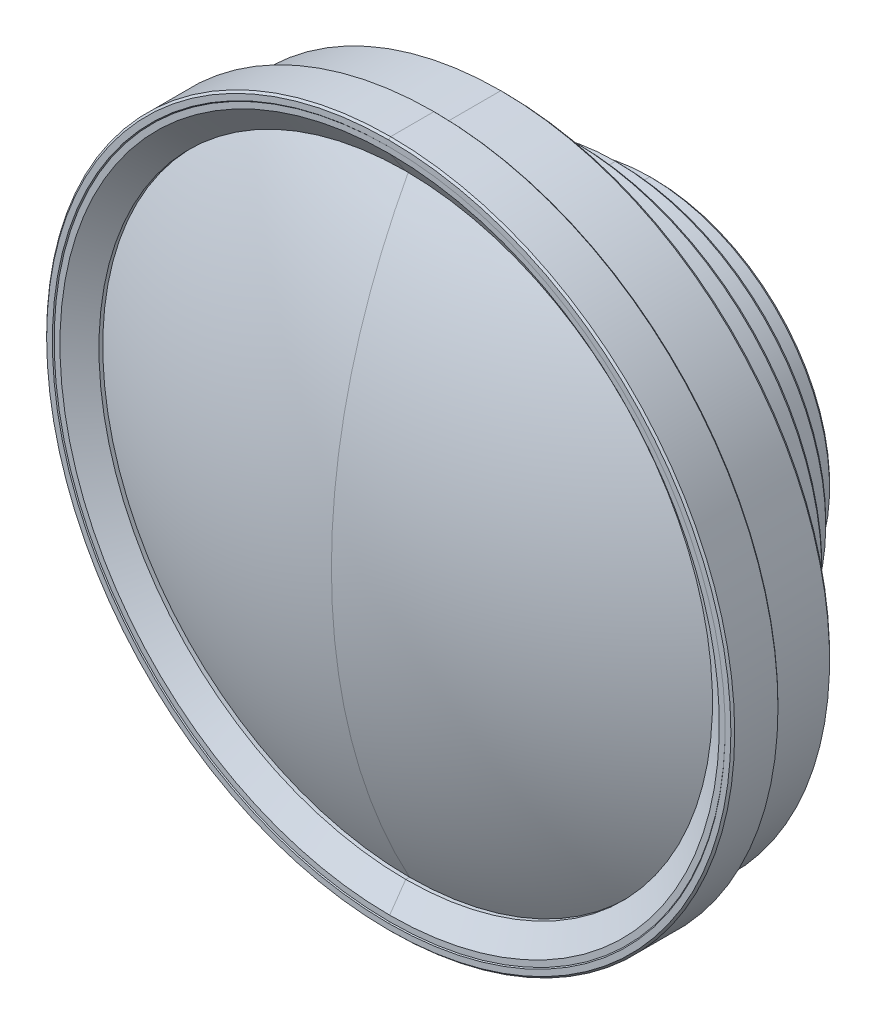
ISO-10303-21;
HEADER;
FILE_DESCRIPTION(('STEP AP214'),'2;1');
FILE_NAME('part.step','',(''),(''),'','','');
FILE_SCHEMA(('AUTOMOTIVE_DESIGN { 1 0 10303 214 1 1 1 1 }'));
ENDSEC;
DATA;
#1=APPLICATION_CONTEXT('core data for automotive mechanical design processes');
#2=APPLICATION_PROTOCOL_DEFINITION('international standard','automotive_design',2000,#1);
#3=PRODUCT_CONTEXT('',#1,'mechanical');
#4=PRODUCT('Part','Part','',(#3));
#5=PRODUCT_RELATED_PRODUCT_CATEGORY('part','',(#4));
#6=PRODUCT_DEFINITION_FORMATION('','',#4);
#7=PRODUCT_DEFINITION_CONTEXT('part definition',#1,'design');
#8=PRODUCT_DEFINITION('design','',#6,#7);
#9=PRODUCT_DEFINITION_SHAPE('','',#8);
#10=(LENGTH_UNIT() NAMED_UNIT(*) SI_UNIT(.MILLI.,.METRE.));
#11=(NAMED_UNIT(*) PLANE_ANGLE_UNIT() SI_UNIT($,.RADIAN.));
#12=(NAMED_UNIT(*) SI_UNIT($,.STERADIAN.) SOLID_ANGLE_UNIT());
#13=UNCERTAINTY_MEASURE_WITH_UNIT(LENGTH_MEASURE(1.E-05),#10,'distance_accuracy_value','');
#14=(GEOMETRIC_REPRESENTATION_CONTEXT(3) GLOBAL_UNCERTAINTY_ASSIGNED_CONTEXT((#13)) GLOBAL_UNIT_ASSIGNED_CONTEXT((#10,
#11,#12)) REPRESENTATION_CONTEXT('',''));
#15=CARTESIAN_POINT('',(0.,0.,0.));
#16=DIRECTION('',(0.,0.,1.));
#17=DIRECTION('',(1.,0.,0.));
#18=AXIS2_PLACEMENT_3D('',#15,#16,#17);
#19=CARTESIAN_POINT('',(0.,0.,-764.4195681488));
#20=DIRECTION('',(0.,0.,-1.));
#21=DIRECTION('',(0.,-1.,0.));
#22=AXIS2_PLACEMENT_3D('',#19,#20,#21);
#23=SPHERICAL_SURFACE('',#22,771.9320364239);
#24=CARTESIAN_POINT('',(0.,0.,6.994453782715));
#25=DIRECTION('',(0.,0.,-1.));
#26=DIRECTION('',(0.,1.,0.));
#27=AXIS2_PLACEMENT_3D('',#24,#25,#26);
#28=CIRCLE('',#27,28.275);
#29=CARTESIAN_POINT('',(0.,28.275,6.994453782715));
#30=VERTEX_POINT('',#29);
#31=CARTESIAN_POINT('',(0.,-28.275,6.994453782715));
#32=VERTEX_POINT('',#31);
#33=EDGE_CURVE('E422',#30,#32,#28,.T.);
#34=ORIENTED_EDGE('',*,*,#33,.T.);
#35=CARTESIAN_POINT('',(0.,0.,-764.4195681488));
#36=DIRECTION('',(1.,0.,0.));
#37=DIRECTION('',(0.,0.,1.));
#38=AXIS2_PLACEMENT_3D('',#35,#36,#37);
#39=CIRCLE('',#38,771.9320364239);
#40=CARTESIAN_POINT('',(0.,0.,7.512468275104));
#41=VERTEX_POINT('',#40);
#42=EDGE_CURVE('E25',#41,#32,#39,.T.);
#43=ORIENTED_EDGE('',*,*,#42,.F.);
#44=CARTESIAN_POINT('',(0.,0.,-764.4195681488));
#45=DIRECTION('',(-1.,0.,0.));
#46=DIRECTION('',(0.,0.,1.));
#47=AXIS2_PLACEMENT_3D('',#44,#45,#46);
#48=CIRCLE('',#47,771.9320364239);
#49=EDGE_CURVE('E9',#41,#30,#48,.T.);
#50=ORIENTED_EDGE('',*,*,#49,.T.);
#51=EDGE_LOOP('',(#34,#43,#50));
#52=FACE_BOUND('',#51,.T.);
#53=ADVANCED_FACE('F14',(#52),#23,.F.);
#54=CARTESIAN_POINT('',(0.,0.,-764.4195681488));
#55=DIRECTION('',(0.,0.,-1.));
#56=DIRECTION('',(0.,-1.,0.));
#57=AXIS2_PLACEMENT_3D('',#54,#55,#56);
#58=SPHERICAL_SURFACE('',#57,771.9320364239);
#59=ORIENTED_EDGE('',*,*,#42,.T.);
#60=CARTESIAN_POINT('',(0.,0.,6.994453782715));
#61=DIRECTION('',(0.,0.,1.));
#62=DIRECTION('',(0.,1.,0.));
#63=AXIS2_PLACEMENT_3D('',#60,#61,#62);
#64=CIRCLE('',#63,28.275);
#65=EDGE_CURVE('E336',#30,#32,#64,.T.);
#66=ORIENTED_EDGE('',*,*,#65,.F.);
#67=ORIENTED_EDGE('',*,*,#49,.F.);
#68=EDGE_LOOP('',(#59,#66,#67));
#69=FACE_BOUND('',#68,.T.);
#70=ADVANCED_FACE('F568',(#69),#58,.F.);
#71=CARTESIAN_POINT('',(0.,0.,-77.28019420175));
#72=DIRECTION('',(0.,0.,-1.));
#73=DIRECTION('',(0.,-1.,0.));
#74=AXIS2_PLACEMENT_3D('',#71,#72,#73);
#75=SPHERICAL_SURFACE('',#74,167.7801892671);
#76=CARTESIAN_POINT('',(0.,0.,70.06338187298));
#77=DIRECTION('',(0.,0.,1.));
#78=DIRECTION('',(0.,1.,0.));
#79=AXIS2_PLACEMENT_3D('',#76,#77,#78);
#80=CIRCLE('',#79,80.25);
#81=CARTESIAN_POINT('',(0.,80.25,70.06338187298));
#82=VERTEX_POINT('',#81);
#83=CARTESIAN_POINT('',(0.,-80.25,70.06338187298));
#84=VERTEX_POINT('',#83);
#85=EDGE_CURVE('E375',#82,#84,#80,.T.);
#86=ORIENTED_EDGE('',*,*,#85,.T.);
#87=CARTESIAN_POINT('',(0.,0.,-77.28019420175));
#88=DIRECTION('',(-1.,0.,0.));
#89=DIRECTION('',(0.,-0.478304383554308,0.878194122431216));
#90=AXIS2_PLACEMENT_3D('',#87,#88,#89);
#91=CIRCLE('',#90,167.7801892671);
#92=CARTESIAN_POINT('',(0.,0.,90.49999506531));
#93=VERTEX_POINT('',#92);
#94=EDGE_CURVE('E360',#84,#93,#91,.T.);
#95=ORIENTED_EDGE('',*,*,#94,.T.);
#96=CARTESIAN_POINT('',(0.,0.,-77.28019420175));
#97=DIRECTION('',(1.,0.,0.));
#98=DIRECTION('',(0.,0.478304383554308,0.878194122431216));
#99=AXIS2_PLACEMENT_3D('',#96,#97,#98);
#100=CIRCLE('',#99,167.7801892671);
#101=EDGE_CURVE('E364',#82,#93,#100,.T.);
#102=ORIENTED_EDGE('',*,*,#101,.F.);
#103=EDGE_LOOP('',(#86,#95,#102));
#104=FACE_BOUND('',#103,.T.);
#105=ADVANCED_FACE('F574',(#104),#75,.T.);
#106=CARTESIAN_POINT('',(0.,0.,-77.28019420175));
#107=DIRECTION('',(0.,0.,-1.));
#108=DIRECTION('',(0.,-1.,0.));
#109=AXIS2_PLACEMENT_3D('',#106,#107,#108);
#110=SPHERICAL_SURFACE('',#109,167.7801892671);
#111=ORIENTED_EDGE('',*,*,#94,.F.);
#112=CARTESIAN_POINT('',(0.,0.,70.06338187298));
#113=DIRECTION('',(0.,0.,-1.));
#114=DIRECTION('',(0.,1.,0.));
#115=AXIS2_PLACEMENT_3D('',#112,#113,#114);
#116=CIRCLE('',#115,80.25);
#117=EDGE_CURVE('E365',#82,#84,#116,.T.);
#118=ORIENTED_EDGE('',*,*,#117,.F.);
#119=ORIENTED_EDGE('',*,*,#101,.T.);
#120=EDGE_LOOP('',(#111,#118,#119));
#121=FACE_BOUND('',#120,.T.);
#122=ADVANCED_FACE('F578',(#121),#110,.T.);
#123=CARTESIAN_POINT('',(0.,0.,94.71599481864));
#124=DIRECTION('',(0.,0.,-1.));
#125=DIRECTION('',(0.,-1.,0.));
#126=AXIS2_PLACEMENT_3D('',#123,#124,#125);
#127=CYLINDRICAL_SURFACE('',#126,80.25);
#128=ORIENTED_EDGE('',*,*,#117,.T.);
#129=DIRECTION('',(0.,0.,-1.));
#130=VECTOR('',#129,1.);
#131=CARTESIAN_POINT('',(0.,-80.25,71.06338187298));
#132=LINE('',#131,#130);
#133=CARTESIAN_POINT('',(0.,-80.25,71.06338187298));
#134=VERTEX_POINT('',#133);
#135=EDGE_CURVE('E371',#134,#84,#132,.T.);
#136=ORIENTED_EDGE('',*,*,#135,.F.);
#137=CARTESIAN_POINT('',(0.,0.,71.06338187298));
#138=DIRECTION('',(0.,0.,-1.));
#139=DIRECTION('',(0.,1.,0.));
#140=AXIS2_PLACEMENT_3D('',#137,#138,#139);
#141=CIRCLE('',#140,80.25);
#142=CARTESIAN_POINT('',(0.,80.25,71.06338187298));
#143=VERTEX_POINT('',#142);
#144=EDGE_CURVE('E277',#143,#134,#141,.T.);
#145=ORIENTED_EDGE('',*,*,#144,.F.);
#146=DIRECTION('',(0.,0.,-1.));
#147=VECTOR('',#146,1.);
#148=CARTESIAN_POINT('',(0.,80.25,71.06338187298));
#149=LINE('',#148,#147);
#150=EDGE_CURVE('E460',#143,#82,#149,.T.);
#151=ORIENTED_EDGE('',*,*,#150,.T.);
#152=EDGE_LOOP('',(#128,#136,#145,#151));
#153=FACE_BOUND('',#152,.T.);
#154=ADVANCED_FACE('F601',(#153),#127,.F.);
#155=CARTESIAN_POINT('',(0.,0.,94.71599481864));
#156=DIRECTION('',(0.,0.,-1.));
#157=DIRECTION('',(0.,-1.,0.));
#158=AXIS2_PLACEMENT_3D('',#155,#156,#157);
#159=CYLINDRICAL_SURFACE('',#158,80.25);
#160=CARTESIAN_POINT('',(0.,0.,71.06338187298));
#161=DIRECTION('',(0.,0.,1.));
#162=DIRECTION('',(0.,1.,0.));
#163=AXIS2_PLACEMENT_3D('',#160,#161,#162);
#164=CIRCLE('',#163,80.25);
#165=EDGE_CURVE('E376',#143,#134,#164,.T.);
#166=ORIENTED_EDGE('',*,*,#165,.T.);
#167=ORIENTED_EDGE('',*,*,#135,.T.);
#168=ORIENTED_EDGE('',*,*,#85,.F.);
#169=ORIENTED_EDGE('',*,*,#150,.F.);
#170=EDGE_LOOP('',(#166,#167,#168,#169));
#171=FACE_BOUND('',#170,.T.);
#172=ADVANCED_FACE('F597',(#171),#159,.F.);
#173=CARTESIAN_POINT('',(0.,0.,73.16338187298));
#174=DIRECTION('',(0.,0.,1.));
#175=DIRECTION('',(0.,1.,0.));
#176=AXIS2_PLACEMENT_3D('',#173,#174,#175);
#177=CONICAL_SURFACE('',#176,83.24911081416,0.9599310885967);
#178=CARTESIAN_POINT('',(0.,0.,75.26338187298));
#179=DIRECTION('',(0.,0.,1.));
#180=DIRECTION('',(0.,1.,0.));
#181=AXIS2_PLACEMENT_3D('',#178,#179,#180);
#182=CIRCLE('',#181,86.24822162832);
#183=CARTESIAN_POINT('',(0.,86.24822162832,75.26338187298));
#184=VERTEX_POINT('',#183);
#185=CARTESIAN_POINT('',(0.,-86.24822162832,75.26338187298));
#186=VERTEX_POINT('',#185);
#187=EDGE_CURVE('E406',#184,#186,#182,.T.);
#188=ORIENTED_EDGE('',*,*,#187,.T.);
#189=DIRECTION('',(0.,0.819152044289016,-0.573576436351011));
#190=VECTOR('',#189,1.);
#191=CARTESIAN_POINT('',(0.,-86.24822162832,75.26338187298));
#192=LINE('',#191,#190);
#193=EDGE_CURVE('E279',#186,#134,#192,.T.);
#194=ORIENTED_EDGE('',*,*,#193,.T.);
#195=ORIENTED_EDGE('',*,*,#165,.F.);
#196=DIRECTION('',(0.,-0.819152044289016,-0.573576436351011));
#197=VECTOR('',#196,1.);
#198=CARTESIAN_POINT('',(0.,86.24822162832,75.26338187298));
#199=LINE('',#198,#197);
#200=EDGE_CURVE('E451',#184,#143,#199,.T.);
#201=ORIENTED_EDGE('',*,*,#200,.F.);
#202=EDGE_LOOP('',(#188,#194,#195,#201));
#203=FACE_BOUND('',#202,.T.);
#204=ADVANCED_FACE('F600',(#203),#177,.F.);
#205=CARTESIAN_POINT('',(0.,0.,73.16338187298));
#206=DIRECTION('',(0.,0.,1.));
#207=DIRECTION('',(0.,1.,0.));
#208=AXIS2_PLACEMENT_3D('',#205,#206,#207);
#209=CONICAL_SURFACE('',#208,83.24911081416,0.9599310885967);
#210=ORIENTED_EDGE('',*,*,#144,.T.);
#211=ORIENTED_EDGE('',*,*,#193,.F.);
#212=CARTESIAN_POINT('',(0.,0.,75.26338187298));
#213=DIRECTION('',(0.,0.,-1.));
#214=DIRECTION('',(0.,1.,0.));
#215=AXIS2_PLACEMENT_3D('',#212,#213,#214);
#216=CIRCLE('',#215,86.24822162832);
#217=EDGE_CURVE('E275',#184,#186,#216,.T.);
#218=ORIENTED_EDGE('',*,*,#217,.F.);
#219=ORIENTED_EDGE('',*,*,#200,.T.);
#220=EDGE_LOOP('',(#210,#211,#218,#219));
#221=FACE_BOUND('',#220,.T.);
#222=ADVANCED_FACE('F834',(#221),#209,.F.);
#223=CARTESIAN_POINT('',(0.,0.,75.26338187298));
#224=DIRECTION('',(0.,0.,-1.));
#225=DIRECTION('',(0.,-1.,0.));
#226=AXIS2_PLACEMENT_3D('',#223,#224,#225);
#227=PLANE('',#226);
#228=ORIENTED_EDGE('',*,*,#187,.F.);
#229=ORIENTED_EDGE('',*,*,#217,.T.);
#230=EDGE_LOOP('',(#228,#229));
#231=FACE_BOUND('',#230,.T.);
#232=CARTESIAN_POINT('',(0.,0.,75.26338187298));
#233=DIRECTION('',(0.,0.,-1.));
#234=DIRECTION('',(0.,1.,0.));
#235=AXIS2_PLACEMENT_3D('',#232,#233,#234);
#236=CIRCLE('',#235,87.76338680767);
#237=CARTESIAN_POINT('',(0.,87.76338680767,75.26338187298));
#238=VERTEX_POINT('',#237);
#239=CARTESIAN_POINT('',(0.,-87.76338680767,75.26338187298));
#240=VERTEX_POINT('',#239);
#241=EDGE_CURVE('E358',#238,#240,#236,.T.);
#242=ORIENTED_EDGE('',*,*,#241,.F.);
#243=CARTESIAN_POINT('',(0.,0.,75.26338187298));
#244=DIRECTION('',(0.,0.,1.));
#245=DIRECTION('',(0.,1.,0.));
#246=AXIS2_PLACEMENT_3D('',#243,#244,#245);
#247=CIRCLE('',#246,87.76338680767);
#248=EDGE_CURVE('E405',#238,#240,#247,.T.);
#249=ORIENTED_EDGE('',*,*,#248,.T.);
#250=EDGE_LOOP('',(#242,#249));
#251=FACE_BOUND('',#250,.T.);
#252=ADVANCED_FACE('F824',(#231,#251),#227,.F.);
#253=CARTESIAN_POINT('',(0.,0.,75.38168846915));
#254=DIRECTION('',(0.,0.,1.));
#255=DIRECTION('',(0.,1.,0.));
#256=AXIS2_PLACEMENT_3D('',#253,#254,#255);
#257=CONICAL_SURFACE('',#256,87.88169340384,0.7853981633973);
#258=CARTESIAN_POINT('',(0.,0.,75.49999506531));
#259=DIRECTION('',(0.,0.,1.));
#260=DIRECTION('',(0.,1.,0.));
#261=AXIS2_PLACEMENT_3D('',#258,#259,#260);
#262=CIRCLE('',#261,88.);
#263=CARTESIAN_POINT('',(0.,88.,75.49999506531));
#264=VERTEX_POINT('',#263);
#265=CARTESIAN_POINT('',(0.,-88.,75.49999506531));
#266=VERTEX_POINT('',#265);
#267=EDGE_CURVE('E393',#264,#266,#262,.T.);
#268=ORIENTED_EDGE('',*,*,#267,.T.);
#269=DIRECTION('',(0.,0.707106781186548,-0.707106781186548));
#270=VECTOR('',#269,1.);
#271=CARTESIAN_POINT('',(0.,-88.,75.49999506531));
#272=LINE('',#271,#270);
#273=EDGE_CURVE('E354',#266,#240,#272,.T.);
#274=ORIENTED_EDGE('',*,*,#273,.T.);
#275=ORIENTED_EDGE('',*,*,#248,.F.);
#276=DIRECTION('',(0.,-0.707106781186548,-0.707106781186548));
#277=VECTOR('',#276,1.);
#278=CARTESIAN_POINT('',(0.,88.,75.49999506531));
#279=LINE('',#278,#277);
#280=EDGE_CURVE('E357',#264,#238,#279,.T.);
#281=ORIENTED_EDGE('',*,*,#280,.F.);
#282=EDGE_LOOP('',(#268,#274,#275,#281));
#283=FACE_BOUND('',#282,.T.);
#284=ADVANCED_FACE('F622',(#283),#257,.F.);
#285=CARTESIAN_POINT('',(0.,0.,75.38168846915));
#286=DIRECTION('',(0.,0.,1.));
#287=DIRECTION('',(0.,1.,0.));
#288=AXIS2_PLACEMENT_3D('',#285,#286,#287);
#289=CONICAL_SURFACE('',#288,87.88169340384,0.7853981633973);
#290=ORIENTED_EDGE('',*,*,#241,.T.);
#291=ORIENTED_EDGE('',*,*,#273,.F.);
#292=CARTESIAN_POINT('',(0.,0.,75.49999506531));
#293=DIRECTION('',(0.,0.,-1.));
#294=DIRECTION('',(0.,1.,0.));
#295=AXIS2_PLACEMENT_3D('',#292,#293,#294);
#296=CIRCLE('',#295,88.);
#297=EDGE_CURVE('E389',#264,#266,#296,.T.);
#298=ORIENTED_EDGE('',*,*,#297,.F.);
#299=ORIENTED_EDGE('',*,*,#280,.T.);
#300=EDGE_LOOP('',(#290,#291,#298,#299));
#301=FACE_BOUND('',#300,.T.);
#302=ADVANCED_FACE('F619',(#301),#289,.F.);
#303=CARTESIAN_POINT('',(0.,0.,75.49999506531));
#304=DIRECTION('',(0.,0.,-1.));
#305=DIRECTION('',(0.,-1.,0.));
#306=AXIS2_PLACEMENT_3D('',#303,#304,#305);
#307=PLANE('',#306);
#308=ORIENTED_EDGE('',*,*,#267,.F.);
#309=ORIENTED_EDGE('',*,*,#297,.T.);
#310=EDGE_LOOP('',(#308,#309));
#311=FACE_BOUND('',#310,.T.);
#312=CARTESIAN_POINT('',(0.,0.,75.499995066));
#313=DIRECTION('',(0.,0.,-1.));
#314=DIRECTION('',(0.,1.,0.));
#315=AXIS2_PLACEMENT_3D('',#312,#313,#314);
#316=CIRCLE('',#315,89.49999999931);
#317=CARTESIAN_POINT('',(0.,89.49999999954,75.49999506577));
#318=VERTEX_POINT('',#317);
#319=CARTESIAN_POINT('',(0.,-89.49999999954,75.49999506577));
#320=VERTEX_POINT('',#319);
#321=EDGE_CURVE('E240',#318,#320,#316,.T.);
#322=ORIENTED_EDGE('',*,*,#321,.F.);
#323=CARTESIAN_POINT('',(0.,0.,75.499995066));
#324=DIRECTION('',(0.,0.,1.));
#325=DIRECTION('',(0.,1.,0.));
#326=AXIS2_PLACEMENT_3D('',#323,#324,#325);
#327=CIRCLE('',#326,89.49999999931);
#328=EDGE_CURVE('E440',#318,#320,#327,.T.);
#329=ORIENTED_EDGE('',*,*,#328,.T.);
#330=EDGE_LOOP('',(#322,#329));
#331=FACE_BOUND('',#330,.T.);
#332=ADVANCED_FACE('F621',(#311,#331),#307,.F.);
#333=CARTESIAN_POINT('',(0.,0.,75.24999506566));
#334=DIRECTION('',(0.,0.,-1.));
#335=DIRECTION('',(0.,-1.,0.));
#336=AXIS2_PLACEMENT_3D('',#333,#334,#335);
#337=CONICAL_SURFACE('',#336,89.74999999965,0.7853981633973);
#338=CARTESIAN_POINT('',(0.,0.,74.99999506531));
#339=DIRECTION('',(0.,0.,1.));
#340=DIRECTION('',(0.,1.,0.));
#341=AXIS2_PLACEMENT_3D('',#338,#339,#340);
#342=CIRCLE('',#341,90.);
#343=CARTESIAN_POINT('',(0.,90.,74.99999506531));
#344=VERTEX_POINT('',#343);
#345=CARTESIAN_POINT('',(0.,-90.,74.99999506531));
#346=VERTEX_POINT('',#345);
#347=EDGE_CURVE('E256',#344,#346,#342,.T.);
#348=ORIENTED_EDGE('',*,*,#347,.T.);
#349=DIRECTION('',(0.,0.707106781186548,0.707106781186548));
#350=VECTOR('',#349,1.);
#351=CARTESIAN_POINT('',(0.,-90.,74.99999506531));
#352=LINE('',#351,#350);
#353=EDGE_CURVE('E233',#346,#320,#352,.T.);
#354=ORIENTED_EDGE('',*,*,#353,.T.);
#355=ORIENTED_EDGE('',*,*,#328,.F.);
#356=DIRECTION('',(0.,-0.707106781186597,0.707106781186498));
#357=VECTOR('',#356,1.);
#358=CARTESIAN_POINT('',(0.,90.,74.99999506531));
#359=LINE('',#358,#357);
#360=EDGE_CURVE('E244',#344,#318,#359,.T.);
#361=ORIENTED_EDGE('',*,*,#360,.F.);
#362=EDGE_LOOP('',(#348,#354,#355,#361));
#363=FACE_BOUND('',#362,.T.);
#364=ADVANCED_FACE('F257',(#363),#337,.T.);
#365=CARTESIAN_POINT('',(0.,0.,75.24999506566));
#366=DIRECTION('',(0.,0.,-1.));
#367=DIRECTION('',(0.,-1.,0.));
#368=AXIS2_PLACEMENT_3D('',#365,#366,#367);
#369=CONICAL_SURFACE('',#368,89.74999999965,0.7853981633973);
#370=ORIENTED_EDGE('',*,*,#321,.T.);
#371=ORIENTED_EDGE('',*,*,#353,.F.);
#372=CARTESIAN_POINT('',(0.,0.,74.99999506531));
#373=DIRECTION('',(0.,0.,-1.));
#374=DIRECTION('',(0.,1.,0.));
#375=AXIS2_PLACEMENT_3D('',#372,#373,#374);
#376=CIRCLE('',#375,90.);
#377=EDGE_CURVE('E237',#344,#346,#376,.T.);
#378=ORIENTED_EDGE('',*,*,#377,.F.);
#379=ORIENTED_EDGE('',*,*,#360,.T.);
#380=EDGE_LOOP('',(#370,#371,#378,#379));
#381=FACE_BOUND('',#380,.T.);
#382=ADVANCED_FACE('F235',(#381),#369,.T.);
#383=CARTESIAN_POINT('',(0.,0.,94.71599481864));
#384=DIRECTION('',(0.,0.,-1.));
#385=DIRECTION('',(0.,-1.,0.));
#386=AXIS2_PLACEMENT_3D('',#383,#384,#385);
#387=CYLINDRICAL_SURFACE('',#386,90.);
#388=ORIENTED_EDGE('',*,*,#377,.T.);
#389=DIRECTION('',(0.,0.,1.));
#390=VECTOR('',#389,1.);
#391=CARTESIAN_POINT('',(0.,-90.,63.68));
#392=LINE('',#391,#390);
#393=CARTESIAN_POINT('',(0.,-90.,63.68));
#394=VERTEX_POINT('',#393);
#395=EDGE_CURVE('E250',#394,#346,#392,.T.);
#396=ORIENTED_EDGE('',*,*,#395,.F.);
#397=CARTESIAN_POINT('',(0.,0.,63.68));
#398=DIRECTION('',(0.,0.,-1.));
#399=DIRECTION('',(0.,1.,0.));
#400=AXIS2_PLACEMENT_3D('',#397,#398,#399);
#401=CIRCLE('',#400,90.);
#402=CARTESIAN_POINT('',(0.,90.,63.68));
#403=VERTEX_POINT('',#402);
#404=EDGE_CURVE('E394',#403,#394,#401,.T.);
#405=ORIENTED_EDGE('',*,*,#404,.F.);
#406=DIRECTION('',(0.,0.,1.));
#407=VECTOR('',#406,1.);
#408=CARTESIAN_POINT('',(0.,90.,63.68));
#409=LINE('',#408,#407);
#410=EDGE_CURVE('E252',#403,#344,#409,.T.);
#411=ORIENTED_EDGE('',*,*,#410,.T.);
#412=EDGE_LOOP('',(#388,#396,#405,#411));
#413=FACE_BOUND('',#412,.T.);
#414=ADVANCED_FACE('F247',(#413),#387,.T.);
#415=CARTESIAN_POINT('',(0.,0.,94.71599481864));
#416=DIRECTION('',(0.,0.,-1.));
#417=DIRECTION('',(0.,-1.,0.));
#418=AXIS2_PLACEMENT_3D('',#415,#416,#417);
#419=CYLINDRICAL_SURFACE('',#418,90.);
#420=CARTESIAN_POINT('',(0.,0.,63.68));
#421=DIRECTION('',(0.,0.,1.));
#422=DIRECTION('',(0.,1.,0.));
#423=AXIS2_PLACEMENT_3D('',#420,#421,#422);
#424=CIRCLE('',#423,90.);
#425=EDGE_CURVE('E263',#403,#394,#424,.T.);
#426=ORIENTED_EDGE('',*,*,#425,.T.);
#427=ORIENTED_EDGE('',*,*,#395,.T.);
#428=ORIENTED_EDGE('',*,*,#347,.F.);
#429=ORIENTED_EDGE('',*,*,#410,.F.);
#430=EDGE_LOOP('',(#426,#427,#428,#429));
#431=FACE_BOUND('',#430,.T.);
#432=ADVANCED_FACE('F261',(#431),#419,.T.);
#433=CARTESIAN_POINT('',(0.,0.,63.4299999998));
#434=DIRECTION('',(0.,0.,1.));
#435=DIRECTION('',(0.,1.,0.));
#436=AXIS2_PLACEMENT_3D('',#433,#434,#435);
#437=CONICAL_SURFACE('',#436,89.7499999998,0.7853981633973);
#438=CARTESIAN_POINT('',(0.,0.,63.1799999996));
#439=DIRECTION('',(0.,0.,1.));
#440=DIRECTION('',(0.,1.,0.));
#441=AXIS2_PLACEMENT_3D('',#438,#439,#440);
#442=CIRCLE('',#441,89.4999999996);
#443=CARTESIAN_POINT('',(0.,89.4999999996,63.1799999996));
#444=VERTEX_POINT('',#443);
#445=CARTESIAN_POINT('',(0.,-89.4999999996,63.1799999996));
#446=VERTEX_POINT('',#445);
#447=EDGE_CURVE('E388',#444,#446,#442,.T.);
#448=ORIENTED_EDGE('',*,*,#447,.T.);
#449=DIRECTION('',(0.,-0.707106781186548,0.707106781186548));
#450=VECTOR('',#449,1.);
#451=CARTESIAN_POINT('',(0.,-89.4999999996,63.1799999996));
#452=LINE('',#451,#450);
#453=EDGE_CURVE('E398',#446,#394,#452,.T.);
#454=ORIENTED_EDGE('',*,*,#453,.T.);
#455=ORIENTED_EDGE('',*,*,#425,.F.);
#456=DIRECTION('',(0.,0.707106781186597,0.707106781186498));
#457=VECTOR('',#456,1.);
#458=CARTESIAN_POINT('',(0.,89.4999999996,63.1799999996));
#459=LINE('',#458,#457);
#460=EDGE_CURVE('E271',#444,#403,#459,.T.);
#461=ORIENTED_EDGE('',*,*,#460,.F.);
#462=EDGE_LOOP('',(#448,#454,#455,#461));
#463=FACE_BOUND('',#462,.T.);
#464=ADVANCED_FACE('F16',(#463),#437,.T.);
#465=CARTESIAN_POINT('',(0.,0.,63.4299999998));
#466=DIRECTION('',(0.,0.,1.));
#467=DIRECTION('',(0.,1.,0.));
#468=AXIS2_PLACEMENT_3D('',#465,#466,#467);
#469=CONICAL_SURFACE('',#468,89.7499999998,0.7853981633973);
#470=ORIENTED_EDGE('',*,*,#404,.T.);
#471=ORIENTED_EDGE('',*,*,#453,.F.);
#472=CARTESIAN_POINT('',(0.,0.,63.1799999996));
#473=DIRECTION('',(0.,0.,-1.));
#474=DIRECTION('',(0.,1.,0.));
#475=AXIS2_PLACEMENT_3D('',#472,#473,#474);
#476=CIRCLE('',#475,89.4999999996);
#477=EDGE_CURVE('E399',#444,#446,#476,.T.);
#478=ORIENTED_EDGE('',*,*,#477,.F.);
#479=ORIENTED_EDGE('',*,*,#460,.T.);
#480=EDGE_LOOP('',(#470,#471,#478,#479));
#481=FACE_BOUND('',#480,.T.);
#482=ADVANCED_FACE('F547',(#481),#469,.T.);
#483=CARTESIAN_POINT('',(0.,0.,63.1799999996));
#484=DIRECTION('',(0.,0.,-1.));
#485=DIRECTION('',(0.,-1.,0.));
#486=AXIS2_PLACEMENT_3D('',#483,#484,#485);
#487=PLANE('',#486);
#488=CARTESIAN_POINT('',(0.,0.,63.1799999996));
#489=DIRECTION('',(0.,0.,-1.));
#490=DIRECTION('',(0.,1.,0.));
#491=AXIS2_PLACEMENT_3D('',#488,#489,#490);
#492=CIRCLE('',#491,86.);
#493=CARTESIAN_POINT('',(0.,86.,63.1799999996));
#494=VERTEX_POINT('',#493);
#495=CARTESIAN_POINT('',(0.,-86.,63.1799999996));
#496=VERTEX_POINT('',#495);
#497=EDGE_CURVE('E385',#494,#496,#492,.T.);
#498=ORIENTED_EDGE('',*,*,#497,.F.);
#499=CARTESIAN_POINT('',(0.,0.,63.1799999996));
#500=DIRECTION('',(0.,0.,1.));
#501=DIRECTION('',(0.,1.,0.));
#502=AXIS2_PLACEMENT_3D('',#499,#500,#501);
#503=CIRCLE('',#502,86.);
#504=EDGE_CURVE('E340',#494,#496,#503,.T.);
#505=ORIENTED_EDGE('',*,*,#504,.T.);
#506=EDGE_LOOP('',(#498,#505));
#507=FACE_BOUND('',#506,.T.);
#508=ORIENTED_EDGE('',*,*,#447,.F.);
#509=ORIENTED_EDGE('',*,*,#477,.T.);
#510=EDGE_LOOP('',(#508,#509));
#511=FACE_BOUND('',#510,.T.);
#512=ADVANCED_FACE('F551',(#507,#511),#487,.T.);
#513=CARTESIAN_POINT('',(0.,0.,94.71599481864));
#514=DIRECTION('',(0.,0.,-1.));
#515=DIRECTION('',(0.,-1.,0.));
#516=AXIS2_PLACEMENT_3D('',#513,#514,#515);
#517=CYLINDRICAL_SURFACE('',#516,86.);
#518=ORIENTED_EDGE('',*,*,#497,.T.);
#519=DIRECTION('',(0.,0.,1.));
#520=VECTOR('',#519,1.);
#521=CARTESIAN_POINT('',(0.,-86.,46.18));
#522=LINE('',#521,#520);
#523=CARTESIAN_POINT('',(0.,-86.,46.18));
#524=VERTEX_POINT('',#523);
#525=EDGE_CURVE('E344',#524,#496,#522,.T.);
#526=ORIENTED_EDGE('',*,*,#525,.F.);
#527=CARTESIAN_POINT('',(0.,0.,46.18));
#528=DIRECTION('',(0.,0.,-1.));
#529=DIRECTION('',(0.,1.,0.));
#530=AXIS2_PLACEMENT_3D('',#527,#528,#529);
#531=CIRCLE('',#530,86.);
#532=CARTESIAN_POINT('',(0.,86.,46.18));
#533=VERTEX_POINT('',#532);
#534=EDGE_CURVE('E348',#533,#524,#531,.T.);
#535=ORIENTED_EDGE('',*,*,#534,.F.);
#536=DIRECTION('',(0.,0.,1.));
#537=VECTOR('',#536,1.);
#538=CARTESIAN_POINT('',(0.,86.,46.18));
#539=LINE('',#538,#537);
#540=EDGE_CURVE('E343',#533,#494,#539,.T.);
#541=ORIENTED_EDGE('',*,*,#540,.T.);
#542=EDGE_LOOP('',(#518,#526,#535,#541));
#543=FACE_BOUND('',#542,.T.);
#544=ADVANCED_FACE('F553',(#543),#517,.T.);
#545=CARTESIAN_POINT('',(0.,0.,94.71599481864));
#546=DIRECTION('',(0.,0.,-1.));
#547=DIRECTION('',(0.,-1.,0.));
#548=AXIS2_PLACEMENT_3D('',#545,#546,#547);
#549=CYLINDRICAL_SURFACE('',#548,86.);
#550=CARTESIAN_POINT('',(0.,0.,46.18));
#551=DIRECTION('',(0.,0.,1.));
#552=DIRECTION('',(0.,1.,0.));
#553=AXIS2_PLACEMENT_3D('',#550,#551,#552);
#554=CIRCLE('',#553,86.);
#555=EDGE_CURVE('E483',#533,#524,#554,.T.);
#556=ORIENTED_EDGE('',*,*,#555,.T.);
#557=ORIENTED_EDGE('',*,*,#525,.T.);
#558=ORIENTED_EDGE('',*,*,#504,.F.);
#559=ORIENTED_EDGE('',*,*,#540,.F.);
#560=EDGE_LOOP('',(#556,#557,#558,#559));
#561=FACE_BOUND('',#560,.T.);
#562=ADVANCED_FACE('F561',(#561),#549,.T.);
#563=CARTESIAN_POINT('',(0.,0.,45.67999999981));
#564=DIRECTION('',(0.,0.,1.));
#565=DIRECTION('',(0.,1.,0.));
#566=AXIS2_PLACEMENT_3D('',#563,#564,#565);
#567=CONICAL_SURFACE('',#566,85.49999999981,0.7853981633973);
#568=CARTESIAN_POINT('',(0.,0.,45.17999999962));
#569=DIRECTION('',(0.,0.,1.));
#570=DIRECTION('',(0.,1.,0.));
#571=AXIS2_PLACEMENT_3D('',#568,#569,#570);
#572=CIRCLE('',#571,84.99999999962);
#573=CARTESIAN_POINT('',(0.,84.99999999962,45.17999999962));
#574=VERTEX_POINT('',#573);
#575=CARTESIAN_POINT('',(0.,-84.99999999962,45.17999999962));
#576=VERTEX_POINT('',#575);
#577=EDGE_CURVE('E302',#574,#576,#572,.T.);
#578=ORIENTED_EDGE('',*,*,#577,.T.);
#579=DIRECTION('',(0.,-0.707106781186548,0.707106781186548));
#580=VECTOR('',#579,1.);
#581=CARTESIAN_POINT('',(0.,-84.99999999962,45.17999999962));
#582=LINE('',#581,#580);
#583=EDGE_CURVE('E349',#576,#524,#582,.T.);
#584=ORIENTED_EDGE('',*,*,#583,.T.);
#585=ORIENTED_EDGE('',*,*,#555,.F.);
#586=DIRECTION('',(0.,0.707106781186597,0.707106781186498));
#587=VECTOR('',#586,1.);
#588=CARTESIAN_POINT('',(0.,84.99999999962,45.17999999962));
#589=LINE('',#588,#587);
#590=EDGE_CURVE('E353',#574,#533,#589,.T.);
#591=ORIENTED_EDGE('',*,*,#590,.F.);
#592=EDGE_LOOP('',(#578,#584,#585,#591));
#593=FACE_BOUND('',#592,.T.);
#594=ADVANCED_FACE('F660',(#593),#567,.T.);
#595=CARTESIAN_POINT('',(0.,0.,45.67999999981));
#596=DIRECTION('',(0.,0.,1.));
#597=DIRECTION('',(0.,1.,0.));
#598=AXIS2_PLACEMENT_3D('',#595,#596,#597);
#599=CONICAL_SURFACE('',#598,85.49999999981,0.7853981633973);
#600=ORIENTED_EDGE('',*,*,#534,.T.);
#601=ORIENTED_EDGE('',*,*,#583,.F.);
#602=CARTESIAN_POINT('',(0.,0.,45.17999999962));
#603=DIRECTION('',(0.,0.,-1.));
#604=DIRECTION('',(0.,1.,0.));
#605=AXIS2_PLACEMENT_3D('',#602,#603,#604);
#606=CIRCLE('',#605,84.99999999962);
#607=EDGE_CURVE('E306',#574,#576,#606,.T.);
#608=ORIENTED_EDGE('',*,*,#607,.F.);
#609=ORIENTED_EDGE('',*,*,#590,.T.);
#610=EDGE_LOOP('',(#600,#601,#608,#609));
#611=FACE_BOUND('',#610,.T.);
#612=ADVANCED_FACE('F590',(#611),#599,.T.);
#613=CARTESIAN_POINT('',(0.,0.,45.17999999962));
#614=DIRECTION('',(0.,0.,-1.));
#615=DIRECTION('',(0.,-1.,0.));
#616=AXIS2_PLACEMENT_3D('',#613,#614,#615);
#617=PLANE('',#616);
#618=CARTESIAN_POINT('',(0.,0.,45.17999999962));
#619=DIRECTION('',(0.,0.,-1.));
#620=DIRECTION('',(0.,1.,0.));
#621=AXIS2_PLACEMENT_3D('',#618,#619,#620);
#622=CIRCLE('',#621,65.);
#623=CARTESIAN_POINT('',(0.,65.,45.17999999962));
#624=VERTEX_POINT('',#623);
#625=CARTESIAN_POINT('',(0.,-65.,45.17999999962));
#626=VERTEX_POINT('',#625);
#627=EDGE_CURVE('E307',#624,#626,#622,.T.);
#628=ORIENTED_EDGE('',*,*,#627,.F.);
#629=CARTESIAN_POINT('',(0.,0.,45.17999999962));
#630=DIRECTION('',(0.,0.,1.));
#631=DIRECTION('',(0.,1.,0.));
#632=AXIS2_PLACEMENT_3D('',#629,#630,#631);
#633=CIRCLE('',#632,65.);
#634=EDGE_CURVE('E447',#624,#626,#633,.T.);
#635=ORIENTED_EDGE('',*,*,#634,.T.);
#636=EDGE_LOOP('',(#628,#635));
#637=FACE_BOUND('',#636,.T.);
#638=ORIENTED_EDGE('',*,*,#577,.F.);
#639=ORIENTED_EDGE('',*,*,#607,.T.);
#640=EDGE_LOOP('',(#638,#639));
#641=FACE_BOUND('',#640,.T.);
#642=ADVANCED_FACE('F586',(#637,#641),#617,.T.);
#643=CARTESIAN_POINT('',(0.,0.,94.71599481864));
#644=DIRECTION('',(0.,0.,-1.));
#645=DIRECTION('',(0.,-1.,0.));
#646=AXIS2_PLACEMENT_3D('',#643,#644,#645);
#647=CYLINDRICAL_SURFACE('',#646,65.);
#648=ORIENTED_EDGE('',*,*,#627,.T.);
#649=DIRECTION('',(0.,0.,1.));
#650=VECTOR('',#649,1.);
#651=CARTESIAN_POINT('',(0.,-65.,27.18));
#652=LINE('',#651,#650);
#653=CARTESIAN_POINT('',(0.,-65.,27.18));
#654=VERTEX_POINT('',#653);
#655=EDGE_CURVE('E511',#654,#626,#652,.T.);
#656=ORIENTED_EDGE('',*,*,#655,.F.);
#657=CARTESIAN_POINT('',(0.,0.,27.18));
#658=DIRECTION('',(0.,0.,-1.));
#659=DIRECTION('',(0.,1.,0.));
#660=AXIS2_PLACEMENT_3D('',#657,#658,#659);
#661=CIRCLE('',#660,65.);
#662=CARTESIAN_POINT('',(0.,65.,27.18));
#663=VERTEX_POINT('',#662);
#664=EDGE_CURVE('E308',#663,#654,#661,.T.);
#665=ORIENTED_EDGE('',*,*,#664,.F.);
#666=DIRECTION('',(0.,0.,1.));
#667=VECTOR('',#666,1.);
#668=CARTESIAN_POINT('',(0.,65.,27.18));
#669=LINE('',#668,#667);
#670=EDGE_CURVE('E443',#663,#624,#669,.T.);
#671=ORIENTED_EDGE('',*,*,#670,.T.);
#672=EDGE_LOOP('',(#648,#656,#665,#671));
#673=FACE_BOUND('',#672,.T.);
#674=ADVANCED_FACE('F589',(#673),#647,.T.);
#675=CARTESIAN_POINT('',(0.,0.,94.71599481864));
#676=DIRECTION('',(0.,0.,-1.));
#677=DIRECTION('',(0.,-1.,0.));
#678=AXIS2_PLACEMENT_3D('',#675,#676,#677);
#679=CYLINDRICAL_SURFACE('',#678,65.);
#680=CARTESIAN_POINT('',(0.,0.,27.18));
#681=DIRECTION('',(0.,0.,1.));
#682=DIRECTION('',(0.,1.,0.));
#683=AXIS2_PLACEMENT_3D('',#680,#681,#682);
#684=CIRCLE('',#683,65.);
#685=EDGE_CURVE('E507',#663,#654,#684,.T.);
#686=ORIENTED_EDGE('',*,*,#685,.T.);
#687=ORIENTED_EDGE('',*,*,#655,.T.);
#688=ORIENTED_EDGE('',*,*,#634,.F.);
#689=ORIENTED_EDGE('',*,*,#670,.F.);
#690=EDGE_LOOP('',(#686,#687,#688,#689));
#691=FACE_BOUND('',#690,.T.);
#692=ADVANCED_FACE('F615',(#691),#679,.T.);
#693=CARTESIAN_POINT('',(0.,0.,26.67999999959));
#694=DIRECTION('',(0.,0.,1.));
#695=DIRECTION('',(0.,1.,0.));
#696=AXIS2_PLACEMENT_3D('',#693,#694,#695);
#697=CONICAL_SURFACE('',#696,64.49999999959,0.7853981633973);
#698=CARTESIAN_POINT('',(0.,0.,26.17999999918));
#699=DIRECTION('',(0.,0.,1.));
#700=DIRECTION('',(0.,1.,0.));
#701=AXIS2_PLACEMENT_3D('',#698,#699,#700);
#702=CIRCLE('',#701,63.99999999918);
#703=CARTESIAN_POINT('',(0.,63.99999999918,26.17999999918));
#704=VERTEX_POINT('',#703);
#705=CARTESIAN_POINT('',(0.,-63.99999999918,26.17999999918));
#706=VERTEX_POINT('',#705);
#707=EDGE_CURVE('E506',#704,#706,#702,.T.);
#708=ORIENTED_EDGE('',*,*,#707,.T.);
#709=DIRECTION('',(0.,-0.707106781186498,0.707106781186597));
#710=VECTOR('',#709,1.);
#711=CARTESIAN_POINT('',(0.,-63.99999999918,26.17999999918));
#712=LINE('',#711,#710);
#713=EDGE_CURVE('E311',#706,#654,#712,.T.);
#714=ORIENTED_EDGE('',*,*,#713,.T.);
#715=ORIENTED_EDGE('',*,*,#685,.F.);
#716=DIRECTION('',(0.,0.707106781186597,0.707106781186498));
#717=VECTOR('',#716,1.);
#718=CARTESIAN_POINT('',(0.,63.99999999918,26.17999999918));
#719=LINE('',#718,#717);
#720=EDGE_CURVE('E512',#704,#663,#719,.T.);
#721=ORIENTED_EDGE('',*,*,#720,.F.);
#722=EDGE_LOOP('',(#708,#714,#715,#721));
#723=FACE_BOUND('',#722,.T.);
#724=ADVANCED_FACE('F611',(#723),#697,.T.);
#725=CARTESIAN_POINT('',(0.,0.,26.67999999959));
#726=DIRECTION('',(0.,0.,1.));
#727=DIRECTION('',(0.,1.,0.));
#728=AXIS2_PLACEMENT_3D('',#725,#726,#727);
#729=CONICAL_SURFACE('',#728,64.49999999959,0.7853981633973);
#730=ORIENTED_EDGE('',*,*,#664,.T.);
#731=ORIENTED_EDGE('',*,*,#713,.F.);
#732=CARTESIAN_POINT('',(0.,0.,26.17999999918));
#733=DIRECTION('',(0.,0.,-1.));
#734=DIRECTION('',(0.,1.,0.));
#735=AXIS2_PLACEMENT_3D('',#732,#733,#734);
#736=CIRCLE('',#735,63.99999999918);
#737=EDGE_CURVE('E18',#704,#706,#736,.T.);
#738=ORIENTED_EDGE('',*,*,#737,.F.);
#739=ORIENTED_EDGE('',*,*,#720,.T.);
#740=EDGE_LOOP('',(#730,#731,#738,#739));
#741=FACE_BOUND('',#740,.T.);
#742=ADVANCED_FACE('F614',(#741),#729,.T.);
#743=CARTESIAN_POINT('',(0.,0.,26.17999999918));
#744=DIRECTION('',(0.,0.,-1.));
#745=DIRECTION('',(0.,-1.,0.));
#746=AXIS2_PLACEMENT_3D('',#743,#744,#745);
#747=PLANE('',#746);
#748=CARTESIAN_POINT('',(0.,0.,26.17999999918));
#749=DIRECTION('',(0.,0.,-1.));
#750=DIRECTION('',(0.,1.,0.));
#751=AXIS2_PLACEMENT_3D('',#748,#749,#750);
#752=CIRCLE('',#751,55.);
#753=CARTESIAN_POINT('',(0.,55.,26.17999999918));
#754=VERTEX_POINT('',#753);
#755=CARTESIAN_POINT('',(0.,-55.,26.17999999918));
#756=VERTEX_POINT('',#755);
#757=EDGE_CURVE('E300',#754,#756,#752,.T.);
#758=ORIENTED_EDGE('',*,*,#757,.F.);
#759=CARTESIAN_POINT('',(0.,0.,26.17999999918));
#760=DIRECTION('',(0.,0.,1.));
#761=DIRECTION('',(0.,1.,0.));
#762=AXIS2_PLACEMENT_3D('',#759,#760,#761);
#763=CIRCLE('',#762,55.);
#764=EDGE_CURVE('E301',#754,#756,#763,.T.);
#765=ORIENTED_EDGE('',*,*,#764,.T.);
#766=EDGE_LOOP('',(#758,#765));
#767=FACE_BOUND('',#766,.T.);
#768=ORIENTED_EDGE('',*,*,#707,.F.);
#769=ORIENTED_EDGE('',*,*,#737,.T.);
#770=EDGE_LOOP('',(#768,#769));
#771=FACE_BOUND('',#770,.T.);
#772=ADVANCED_FACE('F605',(#767,#771),#747,.T.);
#773=CARTESIAN_POINT('',(0.,0.,94.71599481864));
#774=DIRECTION('',(0.,0.,-1.));
#775=DIRECTION('',(0.,-1.,0.));
#776=AXIS2_PLACEMENT_3D('',#773,#774,#775);
#777=CYLINDRICAL_SURFACE('',#776,55.);
#778=ORIENTED_EDGE('',*,*,#757,.T.);
#779=DIRECTION('',(0.,0.,1.));
#780=VECTOR('',#779,1.);
#781=CARTESIAN_POINT('',(0.,-55.,16.18));
#782=LINE('',#781,#780);
#783=CARTESIAN_POINT('',(0.,-55.,16.18));
#784=VERTEX_POINT('',#783);
#785=EDGE_CURVE('E294',#784,#756,#782,.T.);
#786=ORIENTED_EDGE('',*,*,#785,.F.);
#787=CARTESIAN_POINT('',(0.,0.,16.18));
#788=DIRECTION('',(0.,0.,-1.));
#789=DIRECTION('',(0.,1.,0.));
#790=AXIS2_PLACEMENT_3D('',#787,#788,#789);
#791=CIRCLE('',#790,55.);
#792=CARTESIAN_POINT('',(0.,55.,16.18));
#793=VERTEX_POINT('',#792);
#794=EDGE_CURVE('E410',#793,#784,#791,.T.);
#795=ORIENTED_EDGE('',*,*,#794,.F.);
#796=DIRECTION('',(0.,0.,1.));
#797=VECTOR('',#796,1.);
#798=CARTESIAN_POINT('',(0.,55.,16.18));
#799=LINE('',#798,#797);
#800=EDGE_CURVE('E296',#793,#754,#799,.T.);
#801=ORIENTED_EDGE('',*,*,#800,.T.);
#802=EDGE_LOOP('',(#778,#786,#795,#801));
#803=FACE_BOUND('',#802,.T.);
#804=ADVANCED_FACE('F584',(#803),#777,.T.);
#805=CARTESIAN_POINT('',(0.,0.,94.71599481864));
#806=DIRECTION('',(0.,0.,-1.));
#807=DIRECTION('',(0.,-1.,0.));
#808=AXIS2_PLACEMENT_3D('',#805,#806,#807);
#809=CYLINDRICAL_SURFACE('',#808,55.);
#810=CARTESIAN_POINT('',(0.,0.,16.18));
#811=DIRECTION('',(0.,0.,1.));
#812=DIRECTION('',(0.,1.,0.));
#813=AXIS2_PLACEMENT_3D('',#810,#811,#812);
#814=CIRCLE('',#813,55.);
#815=EDGE_CURVE('E291',#793,#784,#814,.T.);
#816=ORIENTED_EDGE('',*,*,#815,.T.);
#817=ORIENTED_EDGE('',*,*,#785,.T.);
#818=ORIENTED_EDGE('',*,*,#764,.F.);
#819=ORIENTED_EDGE('',*,*,#800,.F.);
#820=EDGE_LOOP('',(#816,#817,#818,#819));
#821=FACE_BOUND('',#820,.T.);
#822=ADVANCED_FACE('F580',(#821),#809,.T.);
#823=CARTESIAN_POINT('',(0.,0.,15.67999999955));
#824=DIRECTION('',(0.,0.,1.));
#825=DIRECTION('',(0.,1.,0.));
#826=AXIS2_PLACEMENT_3D('',#823,#824,#825);
#827=CONICAL_SURFACE('',#826,54.49999999955,0.7853981633973);
#828=CARTESIAN_POINT('',(0.,0.,15.1799999991));
#829=DIRECTION('',(0.,0.,1.));
#830=DIRECTION('',(0.,1.,0.));
#831=AXIS2_PLACEMENT_3D('',#828,#829,#830);
#832=CIRCLE('',#831,53.9999999991);
#833=CARTESIAN_POINT('',(0.,53.9999999991,15.1799999991));
#834=VERTEX_POINT('',#833);
#835=CARTESIAN_POINT('',(0.,-53.9999999991,15.1799999991));
#836=VERTEX_POINT('',#835);
#837=EDGE_CURVE('E429',#834,#836,#832,.T.);
#838=ORIENTED_EDGE('',*,*,#837,.T.);
#839=DIRECTION('',(0.,-0.707106781186498,0.707106781186598));
#840=VECTOR('',#839,1.);
#841=CARTESIAN_POINT('',(0.,-53.9999999991,15.1799999991));
#842=LINE('',#841,#840);
#843=EDGE_CURVE('E368',#836,#784,#842,.T.);
#844=ORIENTED_EDGE('',*,*,#843,.T.);
#845=ORIENTED_EDGE('',*,*,#815,.F.);
#846=DIRECTION('',(0.,0.707106781186598,0.707106781186498));
#847=VECTOR('',#846,1.);
#848=CARTESIAN_POINT('',(0.,53.9999999991,15.1799999991));
#849=LINE('',#848,#847);
#850=EDGE_CURVE('E107',#834,#793,#849,.T.);
#851=ORIENTED_EDGE('',*,*,#850,.F.);
#852=EDGE_LOOP('',(#838,#844,#845,#851));
#853=FACE_BOUND('',#852,.T.);
#854=ADVANCED_FACE('F583',(#853),#827,.T.);
#855=CARTESIAN_POINT('',(0.,0.,15.67999999955));
#856=DIRECTION('',(0.,0.,1.));
#857=DIRECTION('',(0.,1.,0.));
#858=AXIS2_PLACEMENT_3D('',#855,#856,#857);
#859=CONICAL_SURFACE('',#858,54.49999999955,0.7853981633973);
#860=ORIENTED_EDGE('',*,*,#794,.T.);
#861=ORIENTED_EDGE('',*,*,#843,.F.);
#862=CARTESIAN_POINT('',(0.,0.,15.1799999991));
#863=DIRECTION('',(0.,0.,-1.));
#864=DIRECTION('',(0.,1.,0.));
#865=AXIS2_PLACEMENT_3D('',#862,#863,#864);
#866=CIRCLE('',#865,53.9999999991);
#867=EDGE_CURVE('E414',#834,#836,#866,.T.);
#868=ORIENTED_EDGE('',*,*,#867,.F.);
#869=ORIENTED_EDGE('',*,*,#850,.T.);
#870=EDGE_LOOP('',(#860,#861,#868,#869));
#871=FACE_BOUND('',#870,.T.);
#872=ADVANCED_FACE('F634',(#871),#859,.T.);
#873=CARTESIAN_POINT('',(0.,0.,15.1799999991));
#874=DIRECTION('',(0.,0.,-1.));
#875=DIRECTION('',(0.,-1.,0.));
#876=AXIS2_PLACEMENT_3D('',#873,#874,#875);
#877=PLANE('',#876);
#878=CARTESIAN_POINT('',(0.,0.,15.1799999991));
#879=DIRECTION('',(0.,0.,-1.));
#880=DIRECTION('',(0.,1.,0.));
#881=AXIS2_PLACEMENT_3D('',#878,#879,#880);
#882=CIRCLE('',#881,47.);
#883=CARTESIAN_POINT('',(0.,47.,15.1799999991));
#884=VERTEX_POINT('',#883);
#885=CARTESIAN_POINT('',(0.,-47.,15.1799999991));
#886=VERTEX_POINT('',#885);
#887=EDGE_CURVE('E122',#884,#886,#882,.T.);
#888=ORIENTED_EDGE('',*,*,#887,.F.);
#889=CARTESIAN_POINT('',(0.,0.,15.1799999991));
#890=DIRECTION('',(0.,0.,1.));
#891=DIRECTION('',(0.,1.,0.));
#892=AXIS2_PLACEMENT_3D('',#889,#890,#891);
#893=CIRCLE('',#892,47.);
#894=EDGE_CURVE('E290',#884,#886,#893,.T.);
#895=ORIENTED_EDGE('',*,*,#894,.T.);
#896=EDGE_LOOP('',(#888,#895));
#897=FACE_BOUND('',#896,.T.);
#898=ORIENTED_EDGE('',*,*,#837,.F.);
#899=ORIENTED_EDGE('',*,*,#867,.T.);
#900=EDGE_LOOP('',(#898,#899));
#901=FACE_BOUND('',#900,.T.);
#902=ADVANCED_FACE('F595',(#897,#901),#877,.T.);
#903=CARTESIAN_POINT('',(0.,0.,94.71599481864));
#904=DIRECTION('',(0.,0.,-1.));
#905=DIRECTION('',(0.,-1.,0.));
#906=AXIS2_PLACEMENT_3D('',#903,#904,#905);
#907=CYLINDRICAL_SURFACE('',#906,47.);
#908=ORIENTED_EDGE('',*,*,#887,.T.);
#909=DIRECTION('',(0.,-8.627409897825E-11,1.));
#910=VECTOR('',#909,1.);
#911=CARTESIAN_POINT('',(0.,-46.99999999931,7.17999999931));
#912=LINE('',#911,#910);
#913=CARTESIAN_POINT('',(0.,-46.99999999931,7.17999999931));
#914=VERTEX_POINT('',#913);
#915=EDGE_CURVE('E285',#914,#886,#912,.T.);
#916=ORIENTED_EDGE('',*,*,#915,.F.);
#917=CARTESIAN_POINT('',(0.,0.,7.18));
#918=DIRECTION('',(0.,0.,-1.));
#919=DIRECTION('',(0.,1.,0.));
#920=AXIS2_PLACEMENT_3D('',#917,#918,#919);
#921=CIRCLE('',#920,47.);
#922=CARTESIAN_POINT('',(0.,46.99999999931,7.17999999931));
#923=VERTEX_POINT('',#922);
#924=EDGE_CURVE('E315',#923,#914,#921,.T.);
#925=ORIENTED_EDGE('',*,*,#924,.F.);
#926=DIRECTION('',(0.,8.627676351351E-11,1.));
#927=VECTOR('',#926,1.);
#928=CARTESIAN_POINT('',(0.,46.99999999931,7.17999999931));
#929=LINE('',#928,#927);
#930=EDGE_CURVE('E430',#923,#884,#929,.T.);
#931=ORIENTED_EDGE('',*,*,#930,.T.);
#932=EDGE_LOOP('',(#908,#916,#925,#931));
#933=FACE_BOUND('',#932,.T.);
#934=ADVANCED_FACE('F591',(#933),#907,.T.);
#935=CARTESIAN_POINT('',(0.,0.,94.71599481864));
#936=DIRECTION('',(0.,0.,-1.));
#937=DIRECTION('',(0.,-1.,0.));
#938=AXIS2_PLACEMENT_3D('',#935,#936,#937);
#939=CYLINDRICAL_SURFACE('',#938,47.);
#940=CARTESIAN_POINT('',(0.,0.,7.18));
#941=DIRECTION('',(0.,0.,1.));
#942=DIRECTION('',(0.,1.,0.));
#943=AXIS2_PLACEMENT_3D('',#940,#941,#942);
#944=CIRCLE('',#943,47.);
#945=EDGE_CURVE('E281',#923,#914,#944,.T.);
#946=ORIENTED_EDGE('',*,*,#945,.T.);
#947=ORIENTED_EDGE('',*,*,#915,.T.);
#948=ORIENTED_EDGE('',*,*,#894,.F.);
#949=ORIENTED_EDGE('',*,*,#930,.F.);
#950=EDGE_LOOP('',(#946,#947,#948,#949));
#951=FACE_BOUND('',#950,.T.);
#952=ADVANCED_FACE('F594',(#951),#939,.T.);
#953=CARTESIAN_POINT('',(0.,0.,6.679999998634));
#954=DIRECTION('',(0.,0.,1.));
#955=DIRECTION('',(0.,1.,0.));
#956=AXIS2_PLACEMENT_3D('',#953,#954,#955);
#957=CONICAL_SURFACE('',#956,46.49999999863,0.7853981633973);
#958=CARTESIAN_POINT('',(0.,0.,6.179999998649));
#959=DIRECTION('',(0.,0.,1.));
#960=DIRECTION('',(0.,1.,0.));
#961=AXIS2_PLACEMENT_3D('',#958,#959,#960);
#962=CIRCLE('',#961,45.99999999865);
#963=CARTESIAN_POINT('',(0.,45.99999999865,6.179999998649));
#964=VERTEX_POINT('',#963);
#965=CARTESIAN_POINT('',(0.,-45.99999999865,6.179999998649));
#966=VERTEX_POINT('',#965);
#967=EDGE_CURVE('E316',#964,#966,#962,.T.);
#968=ORIENTED_EDGE('',*,*,#967,.T.);
#969=DIRECTION('',(0.,-0.707106781186548,0.707106781186548));
#970=VECTOR('',#969,1.);
#971=CARTESIAN_POINT('',(0.,-45.99999999865,6.179999998649));
#972=LINE('',#971,#970);
#973=EDGE_CURVE('E325',#966,#914,#972,.T.);
#974=ORIENTED_EDGE('',*,*,#973,.T.);
#975=ORIENTED_EDGE('',*,*,#945,.F.);
#976=DIRECTION('',(0.,0.707106781186548,0.707106781186548));
#977=VECTOR('',#976,1.);
#978=CARTESIAN_POINT('',(0.,45.99999999865,6.179999998649));
#979=LINE('',#978,#977);
#980=EDGE_CURVE('E286',#964,#923,#979,.T.);
#981=ORIENTED_EDGE('',*,*,#980,.F.);
#982=EDGE_LOOP('',(#968,#974,#975,#981));
#983=FACE_BOUND('',#982,.T.);
#984=ADVANCED_FACE('F607',(#983),#957,.T.);
#985=CARTESIAN_POINT('',(0.,0.,6.679999998634));
#986=DIRECTION('',(0.,0.,1.));
#987=DIRECTION('',(0.,1.,0.));
#988=AXIS2_PLACEMENT_3D('',#985,#986,#987);
#989=CONICAL_SURFACE('',#988,46.49999999863,0.7853981633973);
#990=ORIENTED_EDGE('',*,*,#924,.T.);
#991=ORIENTED_EDGE('',*,*,#973,.F.);
#992=CARTESIAN_POINT('',(0.,0.,6.179999998649));
#993=DIRECTION('',(0.,0.,-1.));
#994=DIRECTION('',(0.,1.,0.));
#995=AXIS2_PLACEMENT_3D('',#992,#993,#994);
#996=CIRCLE('',#995,45.99999999865);
#997=EDGE_CURVE('E312',#964,#966,#996,.T.);
#998=ORIENTED_EDGE('',*,*,#997,.F.);
#999=ORIENTED_EDGE('',*,*,#980,.T.);
#1000=EDGE_LOOP('',(#990,#991,#998,#999));
#1001=FACE_BOUND('',#1000,.T.);
#1002=ADVANCED_FACE('F610',(#1001),#989,.T.);
#1003=CARTESIAN_POINT('',(0.,0.,6.179999998649));
#1004=DIRECTION('',(0.,0.,-1.));
#1005=DIRECTION('',(0.,-1.,0.));
#1006=AXIS2_PLACEMENT_3D('',#1003,#1004,#1005);
#1007=PLANE('',#1006);
#1008=CARTESIAN_POINT('',(0.,0.,6.179999998649));
#1009=DIRECTION('',(0.,0.,-1.));
#1010=DIRECTION('',(0.,1.,0.));
#1011=AXIS2_PLACEMENT_3D('',#1008,#1009,#1010);
#1012=CIRCLE('',#1011,28.275);
#1013=CARTESIAN_POINT('',(0.,28.275,6.179999998649));
#1014=VERTEX_POINT('',#1013);
#1015=CARTESIAN_POINT('',(0.,-28.275,6.179999998649));
#1016=VERTEX_POINT('',#1015);
#1017=EDGE_CURVE('E377',#1014,#1016,#1012,.T.);
#1018=ORIENTED_EDGE('',*,*,#1017,.F.);
#1019=CARTESIAN_POINT('',(0.,0.,6.179999998649));
#1020=DIRECTION('',(0.,0.,1.));
#1021=DIRECTION('',(0.,1.,0.));
#1022=AXIS2_PLACEMENT_3D('',#1019,#1020,#1021);
#1023=CIRCLE('',#1022,28.275);
#1024=EDGE_CURVE('E328',#1014,#1016,#1023,.T.);
#1025=ORIENTED_EDGE('',*,*,#1024,.T.);
#1026=EDGE_LOOP('',(#1018,#1025));
#1027=FACE_BOUND('',#1026,.T.);
#1028=ORIENTED_EDGE('',*,*,#967,.F.);
#1029=ORIENTED_EDGE('',*,*,#997,.T.);
#1030=EDGE_LOOP('',(#1028,#1029));
#1031=FACE_BOUND('',#1030,.T.);
#1032=ADVANCED_FACE('F697',(#1027,#1031),#1007,.T.);
#1033=CARTESIAN_POINT('',(0.,0.,94.71599481864));
#1034=DIRECTION('',(0.,0.,-1.));
#1035=DIRECTION('',(0.,-1.,0.));
#1036=AXIS2_PLACEMENT_3D('',#1033,#1034,#1035);
#1037=CYLINDRICAL_SURFACE('',#1036,28.275);
#1038=ORIENTED_EDGE('',*,*,#65,.T.);
#1039=DIRECTION('',(0.,-1.00327871527E-13,-1.));
#1040=VECTOR('',#1039,1.);
#1041=CARTESIAN_POINT('',(0.,-28.275,6.994453782715));
#1042=LINE('',#1041,#1040);
#1043=EDGE_CURVE('E381',#32,#1016,#1042,.T.);
#1044=ORIENTED_EDGE('',*,*,#1043,.T.);
#1045=ORIENTED_EDGE('',*,*,#1024,.F.);
#1046=DIRECTION('',(0.,1.00327871527E-13,-1.));
#1047=VECTOR('',#1046,1.);
#1048=CARTESIAN_POINT('',(0.,28.275,6.994453782715));
#1049=LINE('',#1048,#1047);
#1050=EDGE_CURVE('E426',#30,#1014,#1049,.T.);
#1051=ORIENTED_EDGE('',*,*,#1050,.F.);
#1052=EDGE_LOOP('',(#1038,#1044,#1045,#1051));
#1053=FACE_BOUND('',#1052,.T.);
#1054=ADVANCED_FACE('F678',(#1053),#1037,.F.);
#1055=CARTESIAN_POINT('',(0.,0.,94.71599481864));
#1056=DIRECTION('',(0.,0.,-1.));
#1057=DIRECTION('',(0.,-1.,0.));
#1058=AXIS2_PLACEMENT_3D('',#1055,#1056,#1057);
#1059=CYLINDRICAL_SURFACE('',#1058,28.275);
#1060=ORIENTED_EDGE('',*,*,#1017,.T.);
#1061=ORIENTED_EDGE('',*,*,#1043,.F.);
#1062=ORIENTED_EDGE('',*,*,#33,.F.);
#1063=ORIENTED_EDGE('',*,*,#1050,.T.);
#1064=EDGE_LOOP('',(#1060,#1061,#1062,#1063));
#1065=FACE_BOUND('',#1064,.T.);
#1066=ADVANCED_FACE('F673',(#1065),#1059,.F.);
#1067=CLOSED_SHELL('',(#53,#70,#105,#122,#154,#172,#204,#222,#252,#284,#302,#332,#364,#382,#414,
#432,#464,#482,#512,#544,#562,#594,#612,#642,#674,#692,#724,#742,#772,#804,#822,#854,#872,#902,
#934,#952,#984,#1002,#1032,#1054,#1066));
#1068=MANIFOLD_SOLID_BREP('B1',#1067);
#1069=ADVANCED_BREP_SHAPE_REPRESENTATION('',(#18,#1068),#14);
#1070=SHAPE_DEFINITION_REPRESENTATION(#9,#1069);
ENDSEC;
END-ISO-10303-21;
